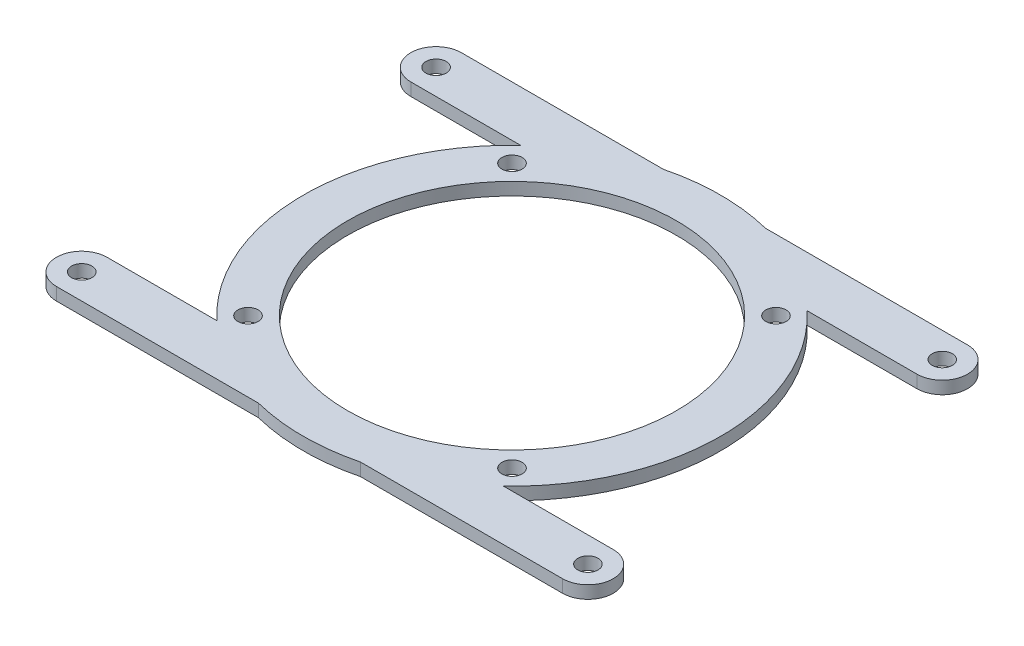
ISO-10303-21;
HEADER;
FILE_DESCRIPTION(('STEP AP214'),'2;1');
FILE_NAME('part.step','',(''),(''),'','','');
FILE_SCHEMA(('AUTOMOTIVE_DESIGN { 1 0 10303 214 1 1 1 1 }'));
ENDSEC;
DATA;
#1=APPLICATION_CONTEXT('core data for automotive mechanical design processes');
#2=APPLICATION_PROTOCOL_DEFINITION('international standard','automotive_design',2000,#1);
#3=PRODUCT_CONTEXT('',#1,'mechanical');
#4=PRODUCT('Part','Part','',(#3));
#5=PRODUCT_RELATED_PRODUCT_CATEGORY('part','',(#4));
#6=PRODUCT_DEFINITION_FORMATION('','',#4);
#7=PRODUCT_DEFINITION_CONTEXT('part definition',#1,'design');
#8=PRODUCT_DEFINITION('design','',#6,#7);
#9=PRODUCT_DEFINITION_SHAPE('','',#8);
#10=(LENGTH_UNIT() NAMED_UNIT(*) SI_UNIT(.MILLI.,.METRE.));
#11=(NAMED_UNIT(*) PLANE_ANGLE_UNIT() SI_UNIT($,.RADIAN.));
#12=(NAMED_UNIT(*) SI_UNIT($,.STERADIAN.) SOLID_ANGLE_UNIT());
#13=UNCERTAINTY_MEASURE_WITH_UNIT(LENGTH_MEASURE(1.E-05),#10,'distance_accuracy_value','');
#14=(GEOMETRIC_REPRESENTATION_CONTEXT(3) GLOBAL_UNCERTAINTY_ASSIGNED_CONTEXT((#13)) GLOBAL_UNIT_ASSIGNED_CONTEXT((#10,
#11,#12)) REPRESENTATION_CONTEXT('',''));
#15=CARTESIAN_POINT('',(0.,0.,0.));
#16=DIRECTION('',(0.,0.,1.));
#17=DIRECTION('',(1.,0.,0.));
#18=AXIS2_PLACEMENT_3D('',#15,#16,#17);
#19=CARTESIAN_POINT('',(0.,-91.9347594764896,-24.));
#20=DIRECTION('',(0.,0.,-1.));
#21=DIRECTION('',(-1.,0.,0.));
#22=AXIS2_PLACEMENT_3D('',#19,#20,#21);
#23=PLANE('',#22);
#24=DIRECTION('',(0.,1.,0.));
#25=VECTOR('',#24,1.);
#26=CARTESIAN_POINT('',(40.,-3.,-24.));
#27=LINE('',#26,#25);
#28=CARTESIAN_POINT('',(40.,0.,-24.));
#29=VERTEX_POINT('',#28);
#30=CARTESIAN_POINT('',(40.,2.,-24.));
#31=VERTEX_POINT('',#30);
#32=EDGE_CURVE('E710',#29,#31,#27,.T.);
#33=ORIENTED_EDGE('',*,*,#32,.T.);
#34=DIRECTION('',(-1.,0.,0.));
#35=VECTOR('',#34,1.);
#36=CARTESIAN_POINT('',(0.,2.,-24.));
#37=LINE('',#36,#35);
#38=CARTESIAN_POINT('',(22.6495033058123,2.,-24.));
#39=VERTEX_POINT('',#38);
#40=EDGE_CURVE('E351',#31,#39,#37,.T.);
#41=ORIENTED_EDGE('',*,*,#40,.T.);
#42=DIRECTION('',(0.,1.,0.));
#43=VECTOR('',#42,1.);
#44=CARTESIAN_POINT('',(22.6495033058123,-91.9347594764896,-24.));
#45=LINE('',#44,#43);
#46=CARTESIAN_POINT('',(22.6495033058123,0.,-24.));
#47=VERTEX_POINT('',#46);
#48=EDGE_CURVE('E353',#47,#39,#45,.T.);
#49=ORIENTED_EDGE('',*,*,#48,.F.);
#50=DIRECTION('',(1.,0.,0.));
#51=VECTOR('',#50,1.);
#52=CARTESIAN_POINT('',(0.,0.,-24.));
#53=LINE('',#52,#51);
#54=EDGE_CURVE('E346',#47,#29,#53,.T.);
#55=ORIENTED_EDGE('',*,*,#54,.T.);
#56=EDGE_LOOP('',(#33,#41,#49,#55));
#57=FACE_BOUND('',#56,.T.);
#58=ADVANCED_FACE('F160',(#57),#23,.F.);
#59=CARTESIAN_POINT('',(0.,2.,0.));
#60=DIRECTION('',(0.,-1.,0.));
#61=DIRECTION('',(0.,0.,-1.));
#62=AXIS2_PLACEMENT_3D('',#59,#60,#61);
#63=CYLINDRICAL_SURFACE('',#62,33.);
#64=DIRECTION('',(0.,1.,0.));
#65=VECTOR('',#64,1.);
#66=CARTESIAN_POINT('',(8.06225774829853,-91.9347594764896,32.));
#67=LINE('',#66,#65);
#68=CARTESIAN_POINT('',(8.06225774829853,0.,32.));
#69=VERTEX_POINT('',#68);
#70=CARTESIAN_POINT('',(8.06225774829853,2.,32.));
#71=VERTEX_POINT('',#70);
#72=EDGE_CURVE('E300',#69,#71,#67,.T.);
#73=ORIENTED_EDGE('',*,*,#72,.T.);
#74=CARTESIAN_POINT('',(0.,2.,0.));
#75=DIRECTION('',(0.,1.,0.));
#76=DIRECTION('',(0.,0.,1.));
#77=AXIS2_PLACEMENT_3D('',#74,#75,#76);
#78=CIRCLE('',#77,33.);
#79=CARTESIAN_POINT('',(-8.06225774829853,2.,32.));
#80=VERTEX_POINT('',#79);
#81=EDGE_CURVE('E299',#80,#71,#78,.T.);
#82=ORIENTED_EDGE('',*,*,#81,.F.);
#83=DIRECTION('',(0.,1.,0.));
#84=VECTOR('',#83,1.);
#85=CARTESIAN_POINT('',(-8.06225774829853,-91.9347594764896,32.));
#86=LINE('',#85,#84);
#87=CARTESIAN_POINT('',(-8.06225774829853,0.,32.));
#88=VERTEX_POINT('',#87);
#89=EDGE_CURVE('E320',#88,#80,#86,.T.);
#90=ORIENTED_EDGE('',*,*,#89,.F.);
#91=CARTESIAN_POINT('',(0.,0.,0.));
#92=DIRECTION('',(0.,1.,0.));
#93=DIRECTION('',(0.,0.,1.));
#94=AXIS2_PLACEMENT_3D('',#91,#92,#93);
#95=CIRCLE('',#94,33.);
#96=EDGE_CURVE('E716',#88,#69,#95,.T.);
#97=ORIENTED_EDGE('',*,*,#96,.T.);
#98=EDGE_LOOP('',(#73,#82,#90,#97));
#99=FACE_BOUND('',#98,.T.);
#100=ADVANCED_FACE('F435',(#99),#63,.T.);
#101=DIRECTION('',(0.,1.,0.));
#102=VECTOR('',#101,1.);
#103=CARTESIAN_POINT('',(-22.6495033058123,-91.9347594764896,24.));
#104=LINE('',#103,#102);
#105=CARTESIAN_POINT('',(-22.6495033058122,0.,24.));
#106=VERTEX_POINT('',#105);
#107=CARTESIAN_POINT('',(-22.6495033058122,2.,24.));
#108=VERTEX_POINT('',#107);
#109=EDGE_CURVE('E323',#106,#108,#104,.T.);
#110=ORIENTED_EDGE('',*,*,#109,.T.);
#111=CARTESIAN_POINT('',(-22.6495033058123,2.,-24.));
#112=VERTEX_POINT('',#111);
#113=EDGE_CURVE('E396',#112,#108,#78,.T.);
#114=ORIENTED_EDGE('',*,*,#113,.F.);
#115=DIRECTION('',(0.,1.,0.));
#116=VECTOR('',#115,1.);
#117=CARTESIAN_POINT('',(-22.6495033058123,-91.9347594764896,-24.));
#118=LINE('',#117,#116);
#119=CARTESIAN_POINT('',(-22.6495033058123,0.,-24.));
#120=VERTEX_POINT('',#119);
#121=EDGE_CURVE('E338',#120,#112,#118,.T.);
#122=ORIENTED_EDGE('',*,*,#121,.F.);
#123=EDGE_CURVE('E401',#120,#106,#95,.T.);
#124=ORIENTED_EDGE('',*,*,#123,.T.);
#125=EDGE_LOOP('',(#110,#114,#122,#124));
#126=FACE_BOUND('',#125,.T.);
#127=ADVANCED_FACE('F162',(#126),#63,.T.);
#128=CARTESIAN_POINT('',(22.6495033058123,2.,24.));
#129=VERTEX_POINT('',#128);
#130=EDGE_CURVE('E397',#129,#39,#78,.T.);
#131=ORIENTED_EDGE('',*,*,#130,.F.);
#132=DIRECTION('',(0.,1.,0.));
#133=VECTOR('',#132,1.);
#134=CARTESIAN_POINT('',(22.6495033058123,-91.9347594764896,24.));
#135=LINE('',#134,#133);
#136=CARTESIAN_POINT('',(22.6495033058123,0.,24.));
#137=VERTEX_POINT('',#136);
#138=EDGE_CURVE('E302',#137,#129,#135,.T.);
#139=ORIENTED_EDGE('',*,*,#138,.F.);
#140=EDGE_CURVE('E390',#137,#47,#95,.T.);
#141=ORIENTED_EDGE('',*,*,#140,.T.);
#142=ORIENTED_EDGE('',*,*,#48,.T.);
#143=EDGE_LOOP('',(#131,#139,#141,#142));
#144=FACE_BOUND('',#143,.T.);
#145=ADVANCED_FACE('F443',(#144),#63,.T.);
#146=CARTESIAN_POINT('',(8.06225774829853,0.,-32.));
#147=VERTEX_POINT('',#146);
#148=CARTESIAN_POINT('',(-8.06225774829853,0.,-32.));
#149=VERTEX_POINT('',#148);
#150=EDGE_CURVE('E398',#147,#149,#95,.T.);
#151=ORIENTED_EDGE('',*,*,#150,.T.);
#152=DIRECTION('',(0.,1.,0.));
#153=VECTOR('',#152,1.);
#154=CARTESIAN_POINT('',(-8.06225774829853,-91.9347594764896,-32.));
#155=LINE('',#154,#153);
#156=CARTESIAN_POINT('',(-8.06225774829853,2.,-32.));
#157=VERTEX_POINT('',#156);
#158=EDGE_CURVE('E319',#149,#157,#155,.T.);
#159=ORIENTED_EDGE('',*,*,#158,.T.);
#160=CARTESIAN_POINT('',(8.06225774829853,2.,-32.));
#161=VERTEX_POINT('',#160);
#162=EDGE_CURVE('E393',#161,#157,#78,.T.);
#163=ORIENTED_EDGE('',*,*,#162,.F.);
#164=DIRECTION('',(0.,1.,0.));
#165=VECTOR('',#164,1.);
#166=CARTESIAN_POINT('',(8.06225774829853,-91.9347594764896,-32.));
#167=LINE('',#166,#165);
#168=EDGE_CURVE('E350',#147,#161,#167,.T.);
#169=ORIENTED_EDGE('',*,*,#168,.F.);
#170=EDGE_LOOP('',(#151,#159,#163,#169));
#171=FACE_BOUND('',#170,.T.);
#172=ADVANCED_FACE('F469',(#171),#63,.T.);
#173=CARTESIAN_POINT('',(0.,2.,0.));
#174=DIRECTION('',(0.,1.,0.));
#175=DIRECTION('',(0.,0.,1.));
#176=AXIS2_PLACEMENT_3D('',#173,#174,#175);
#177=PLANE('',#176);
#178=CARTESIAN_POINT('',(40.,2.,-28.));
#179=DIRECTION('',(0.,-1.,0.));
#180=DIRECTION('',(0.,0.,1.));
#181=AXIS2_PLACEMENT_3D('',#178,#179,#180);
#182=CIRCLE('',#181,4.00000000000001);
#183=CARTESIAN_POINT('',(40.,2.,-32.));
#184=VERTEX_POINT('',#183);
#185=EDGE_CURVE('E746',#184,#31,#182,.T.);
#186=ORIENTED_EDGE('',*,*,#185,.F.);
#187=DIRECTION('',(-1.,0.,0.));
#188=VECTOR('',#187,1.);
#189=CARTESIAN_POINT('',(0.,2.,-32.));
#190=LINE('',#189,#188);
#191=EDGE_CURVE('E347',#184,#161,#190,.T.);
#192=ORIENTED_EDGE('',*,*,#191,.T.);
#193=ORIENTED_EDGE('',*,*,#162,.T.);
#194=DIRECTION('',(-1.,0.,0.));
#195=VECTOR('',#194,1.);
#196=CARTESIAN_POINT('',(0.,2.,-32.));
#197=LINE('',#196,#195);
#198=CARTESIAN_POINT('',(-40.,2.,-32.));
#199=VERTEX_POINT('',#198);
#200=EDGE_CURVE('E332',#157,#199,#197,.T.);
#201=ORIENTED_EDGE('',*,*,#200,.T.);
#202=CARTESIAN_POINT('',(-40.,2.,-28.));
#203=DIRECTION('',(0.,-1.,0.));
#204=DIRECTION('',(0.,0.,-1.));
#205=AXIS2_PLACEMENT_3D('',#202,#203,#204);
#206=CIRCLE('',#205,4.00000000000001);
#207=CARTESIAN_POINT('',(-40.,2.,-24.));
#208=VERTEX_POINT('',#207);
#209=EDGE_CURVE('E705',#208,#199,#206,.T.);
#210=ORIENTED_EDGE('',*,*,#209,.F.);
#211=DIRECTION('',(1.,0.,0.));
#212=VECTOR('',#211,1.);
#213=CARTESIAN_POINT('',(0.,2.,-24.));
#214=LINE('',#213,#212);
#215=EDGE_CURVE('E336',#208,#112,#214,.T.);
#216=ORIENTED_EDGE('',*,*,#215,.T.);
#217=ORIENTED_EDGE('',*,*,#113,.T.);
#218=DIRECTION('',(1.,0.,0.));
#219=VECTOR('',#218,1.);
#220=CARTESIAN_POINT('',(0.,2.,24.));
#221=LINE('',#220,#219);
#222=CARTESIAN_POINT('',(-40.,2.,24.));
#223=VERTEX_POINT('',#222);
#224=EDGE_CURVE('E321',#223,#108,#221,.T.);
#225=ORIENTED_EDGE('',*,*,#224,.F.);
#226=CARTESIAN_POINT('',(-40.,2.,28.));
#227=DIRECTION('',(0.,-1.,0.));
#228=DIRECTION('',(0.,0.,1.));
#229=AXIS2_PLACEMENT_3D('',#226,#227,#228);
#230=CIRCLE('',#229,4.00000000000001);
#231=CARTESIAN_POINT('',(-40.,2.,32.));
#232=VERTEX_POINT('',#231);
#233=EDGE_CURVE('E292',#232,#223,#230,.T.);
#234=ORIENTED_EDGE('',*,*,#233,.F.);
#235=DIRECTION('',(-1.,0.,0.));
#236=VECTOR('',#235,1.);
#237=CARTESIAN_POINT('',(0.,2.,32.));
#238=LINE('',#237,#236);
#239=EDGE_CURVE('E316',#80,#232,#238,.T.);
#240=ORIENTED_EDGE('',*,*,#239,.F.);
#241=ORIENTED_EDGE('',*,*,#81,.T.);
#242=DIRECTION('',(-1.,0.,0.));
#243=VECTOR('',#242,1.);
#244=CARTESIAN_POINT('',(0.,2.,32.));
#245=LINE('',#244,#243);
#246=CARTESIAN_POINT('',(40.,2.,32.));
#247=VERTEX_POINT('',#246);
#248=EDGE_CURVE('E288',#247,#71,#245,.T.);
#249=ORIENTED_EDGE('',*,*,#248,.F.);
#250=CARTESIAN_POINT('',(40.,2.,28.));
#251=DIRECTION('',(0.,-1.,0.));
#252=DIRECTION('',(0.,0.,-1.));
#253=AXIS2_PLACEMENT_3D('',#250,#251,#252);
#254=CIRCLE('',#253,4.00000000000001);
#255=CARTESIAN_POINT('',(40.,2.,24.));
#256=VERTEX_POINT('',#255);
#257=EDGE_CURVE('E273',#256,#247,#254,.T.);
#258=ORIENTED_EDGE('',*,*,#257,.F.);
#259=DIRECTION('',(-1.,0.,0.));
#260=VECTOR('',#259,1.);
#261=CARTESIAN_POINT('',(0.,2.,24.));
#262=LINE('',#261,#260);
#263=EDGE_CURVE('E308',#256,#129,#262,.T.);
#264=ORIENTED_EDGE('',*,*,#263,.T.);
#265=ORIENTED_EDGE('',*,*,#130,.T.);
#266=ORIENTED_EDGE('',*,*,#40,.F.);
#267=EDGE_LOOP('',(#186,#192,#193,#201,#210,#216,#217,#225,#234,#240,#241,#249,#258,#264,#265,#266));
#268=FACE_BOUND('',#267,.T.);
#269=CARTESIAN_POINT('',(40.,2.,-28.));
#270=DIRECTION('',(0.,1.,0.));
#271=DIRECTION('',(0.,0.,1.));
#272=AXIS2_PLACEMENT_3D('',#269,#270,#271);
#273=CIRCLE('',#272,1.6);
#274=CARTESIAN_POINT('',(40.,2.,-26.4));
#275=VERTEX_POINT('',#274);
#276=EDGE_CURVE('E737',#275,#275,#273,.T.);
#277=ORIENTED_EDGE('',*,*,#276,.F.);
#278=EDGE_LOOP('',(#277));
#279=FACE_BOUND('',#278,.T.);
#280=CARTESIAN_POINT('',(-40.,2.,-28.));
#281=DIRECTION('',(0.,1.,0.));
#282=DIRECTION('',(0.,0.,-1.));
#283=AXIS2_PLACEMENT_3D('',#280,#281,#282);
#284=CIRCLE('',#283,1.6);
#285=CARTESIAN_POINT('',(-40.,2.,-29.6));
#286=VERTEX_POINT('',#285);
#287=EDGE_CURVE('E743',#286,#286,#284,.T.);
#288=ORIENTED_EDGE('',*,*,#287,.F.);
#289=EDGE_LOOP('',(#288));
#290=FACE_BOUND('',#289,.T.);
#291=CARTESIAN_POINT('',(-40.,2.,28.));
#292=DIRECTION('',(0.,1.,0.));
#293=DIRECTION('',(0.,0.,1.));
#294=AXIS2_PLACEMENT_3D('',#291,#292,#293);
#295=CIRCLE('',#294,1.6);
#296=CARTESIAN_POINT('',(-40.,2.,29.6));
#297=VERTEX_POINT('',#296);
#298=EDGE_CURVE('E740',#297,#297,#295,.T.);
#299=ORIENTED_EDGE('',*,*,#298,.F.);
#300=EDGE_LOOP('',(#299));
#301=FACE_BOUND('',#300,.T.);
#302=CARTESIAN_POINT('',(40.,2.,28.));
#303=DIRECTION('',(0.,1.,0.));
#304=DIRECTION('',(0.,0.,-1.));
#305=AXIS2_PLACEMENT_3D('',#302,#303,#304);
#306=CIRCLE('',#305,1.6);
#307=CARTESIAN_POINT('',(40.,2.,26.4));
#308=VERTEX_POINT('',#307);
#309=EDGE_CURVE('E744',#308,#308,#306,.T.);
#310=ORIENTED_EDGE('',*,*,#309,.F.);
#311=EDGE_LOOP('',(#310));
#312=FACE_BOUND('',#311,.T.);
#313=CARTESIAN_POINT('',(-20.8596500450031,2.,20.8596500450032));
#314=DIRECTION('',(0.,1.,0.));
#315=DIRECTION('',(0.,0.,1.));
#316=AXIS2_PLACEMENT_3D('',#313,#314,#315);
#317=CIRCLE('',#316,1.6);
#318=CARTESIAN_POINT('',(-20.8596500450031,2.,22.4596500450032));
#319=VERTEX_POINT('',#318);
#320=EDGE_CURVE('E363',#319,#319,#317,.T.);
#321=ORIENTED_EDGE('',*,*,#320,.F.);
#322=EDGE_LOOP('',(#321));
#323=FACE_BOUND('',#322,.T.);
#324=CARTESIAN_POINT('',(-20.8596500450031,2.,-20.8596500450032));
#325=DIRECTION('',(0.,1.,0.));
#326=DIRECTION('',(0.,0.,-1.));
#327=AXIS2_PLACEMENT_3D('',#324,#325,#326);
#328=CIRCLE('',#327,1.6);
#329=CARTESIAN_POINT('',(-20.8596500450031,2.,-22.4596500450032));
#330=VERTEX_POINT('',#329);
#331=EDGE_CURVE('E375',#330,#330,#328,.T.);
#332=ORIENTED_EDGE('',*,*,#331,.F.);
#333=EDGE_LOOP('',(#332));
#334=FACE_BOUND('',#333,.T.);
#335=CARTESIAN_POINT('',(20.8596500450031,2.,-20.8596500450032));
#336=DIRECTION('',(0.,1.,0.));
#337=DIRECTION('',(0.,0.,1.));
#338=AXIS2_PLACEMENT_3D('',#335,#336,#337);
#339=CIRCLE('',#338,1.6);
#340=CARTESIAN_POINT('',(20.8596500450031,2.,-19.2596500450032));
#341=VERTEX_POINT('',#340);
#342=EDGE_CURVE('E381',#341,#341,#339,.T.);
#343=ORIENTED_EDGE('',*,*,#342,.F.);
#344=EDGE_LOOP('',(#343));
#345=FACE_BOUND('',#344,.T.);
#346=CARTESIAN_POINT('',(20.8596500450031,2.,20.8596500450032));
#347=DIRECTION('',(0.,1.,0.));
#348=DIRECTION('',(0.,0.,-1.));
#349=AXIS2_PLACEMENT_3D('',#346,#347,#348);
#350=CIRCLE('',#349,1.6);
#351=CARTESIAN_POINT('',(20.8596500450031,2.,19.2596500450032));
#352=VERTEX_POINT('',#351);
#353=EDGE_CURVE('E369',#352,#352,#350,.T.);
#354=ORIENTED_EDGE('',*,*,#353,.F.);
#355=EDGE_LOOP('',(#354));
#356=FACE_BOUND('',#355,.T.);
#357=CARTESIAN_POINT('',(0.,2.,0.));
#358=DIRECTION('',(0.,1.,0.));
#359=DIRECTION('',(0.,0.,1.));
#360=AXIS2_PLACEMENT_3D('',#357,#358,#359);
#361=CIRCLE('',#360,26.);
#362=CARTESIAN_POINT('',(0.,2.,26.));
#363=VERTEX_POINT('',#362);
#364=EDGE_CURVE('E387',#363,#363,#361,.T.);
#365=ORIENTED_EDGE('',*,*,#364,.F.);
#366=EDGE_LOOP('',(#365));
#367=FACE_BOUND('',#366,.T.);
#368=ADVANCED_FACE('F296',(#268,#279,#290,#301,#312,#323,#334,#345,#356,#367),#177,.T.);
#369=CARTESIAN_POINT('',(0.,0.,0.));
#370=DIRECTION('',(0.,1.,0.));
#371=DIRECTION('',(0.,0.,1.));
#372=AXIS2_PLACEMENT_3D('',#369,#370,#371);
#373=PLANE('',#372);
#374=CARTESIAN_POINT('',(40.,0.,-28.));
#375=DIRECTION('',(0.,1.,0.));
#376=DIRECTION('',(0.,0.,1.));
#377=AXIS2_PLACEMENT_3D('',#374,#375,#376);
#378=CIRCLE('',#377,1.6);
#379=CARTESIAN_POINT('',(40.,0.,-26.4));
#380=VERTEX_POINT('',#379);
#381=EDGE_CURVE('E164',#380,#380,#378,.T.);
#382=ORIENTED_EDGE('',*,*,#381,.T.);
#383=EDGE_LOOP('',(#382));
#384=FACE_BOUND('',#383,.T.);
#385=CARTESIAN_POINT('',(-40.,0.,-28.));
#386=DIRECTION('',(0.,1.,0.));
#387=DIRECTION('',(0.,0.,1.));
#388=AXIS2_PLACEMENT_3D('',#385,#386,#387);
#389=CIRCLE('',#388,1.6);
#390=CARTESIAN_POINT('',(-40.,0.,-26.4));
#391=VERTEX_POINT('',#390);
#392=EDGE_CURVE('E412',#391,#391,#389,.T.);
#393=ORIENTED_EDGE('',*,*,#392,.T.);
#394=EDGE_LOOP('',(#393));
#395=FACE_BOUND('',#394,.T.);
#396=CARTESIAN_POINT('',(-40.,0.,28.));
#397=DIRECTION('',(0.,1.,0.));
#398=DIRECTION('',(0.,0.,1.));
#399=AXIS2_PLACEMENT_3D('',#396,#397,#398);
#400=CIRCLE('',#399,1.6);
#401=CARTESIAN_POINT('',(-40.,0.,29.6));
#402=VERTEX_POINT('',#401);
#403=EDGE_CURVE('E410',#402,#402,#400,.T.);
#404=ORIENTED_EDGE('',*,*,#403,.T.);
#405=EDGE_LOOP('',(#404));
#406=FACE_BOUND('',#405,.T.);
#407=CARTESIAN_POINT('',(40.,0.,28.));
#408=DIRECTION('',(0.,1.,0.));
#409=DIRECTION('',(0.,0.,1.));
#410=AXIS2_PLACEMENT_3D('',#407,#408,#409);
#411=CIRCLE('',#410,1.6);
#412=CARTESIAN_POINT('',(40.,0.,29.6));
#413=VERTEX_POINT('',#412);
#414=EDGE_CURVE('E407',#413,#413,#411,.T.);
#415=ORIENTED_EDGE('',*,*,#414,.T.);
#416=EDGE_LOOP('',(#415));
#417=FACE_BOUND('',#416,.T.);
#418=CARTESIAN_POINT('',(0.,0.,0.));
#419=DIRECTION('',(0.,1.,0.));
#420=DIRECTION('',(0.,0.,1.));
#421=AXIS2_PLACEMENT_3D('',#418,#419,#420);
#422=CIRCLE('',#421,26.);
#423=CARTESIAN_POINT('',(0.,0.,26.));
#424=VERTEX_POINT('',#423);
#425=EDGE_CURVE('E384',#424,#424,#422,.T.);
#426=ORIENTED_EDGE('',*,*,#425,.T.);
#427=EDGE_LOOP('',(#426));
#428=FACE_BOUND('',#427,.T.);
#429=CARTESIAN_POINT('',(20.8596500450031,0.,-20.8596500450032));
#430=DIRECTION('',(0.,1.,0.));
#431=DIRECTION('',(0.,0.,1.));
#432=AXIS2_PLACEMENT_3D('',#429,#430,#431);
#433=CIRCLE('',#432,1.6);
#434=CARTESIAN_POINT('',(20.8596500450031,0.,-19.2596500450032));
#435=VERTEX_POINT('',#434);
#436=EDGE_CURVE('E378',#435,#435,#433,.T.);
#437=ORIENTED_EDGE('',*,*,#436,.T.);
#438=EDGE_LOOP('',(#437));
#439=FACE_BOUND('',#438,.T.);
#440=CARTESIAN_POINT('',(-20.8596500450031,0.,-20.8596500450032));
#441=DIRECTION('',(0.,1.,0.));
#442=DIRECTION('',(0.,0.,-1.));
#443=AXIS2_PLACEMENT_3D('',#440,#441,#442);
#444=CIRCLE('',#443,1.6);
#445=CARTESIAN_POINT('',(-20.8596500450031,0.,-22.4596500450032));
#446=VERTEX_POINT('',#445);
#447=EDGE_CURVE('E372',#446,#446,#444,.T.);
#448=ORIENTED_EDGE('',*,*,#447,.T.);
#449=EDGE_LOOP('',(#448));
#450=FACE_BOUND('',#449,.T.);
#451=CARTESIAN_POINT('',(20.8596500450031,0.,20.8596500450032));
#452=DIRECTION('',(0.,1.,0.));
#453=DIRECTION('',(0.,0.,-1.));
#454=AXIS2_PLACEMENT_3D('',#451,#452,#453);
#455=CIRCLE('',#454,1.6);
#456=CARTESIAN_POINT('',(20.8596500450031,0.,19.2596500450032));
#457=VERTEX_POINT('',#456);
#458=EDGE_CURVE('E366',#457,#457,#455,.T.);
#459=ORIENTED_EDGE('',*,*,#458,.T.);
#460=EDGE_LOOP('',(#459));
#461=FACE_BOUND('',#460,.T.);
#462=CARTESIAN_POINT('',(-20.8596500450031,0.,20.8596500450032));
#463=DIRECTION('',(0.,1.,0.));
#464=DIRECTION('',(0.,0.,1.));
#465=AXIS2_PLACEMENT_3D('',#462,#463,#464);
#466=CIRCLE('',#465,1.6);
#467=CARTESIAN_POINT('',(-20.8596500450031,0.,22.4596500450032));
#468=VERTEX_POINT('',#467);
#469=EDGE_CURVE('E362',#468,#468,#466,.T.);
#470=ORIENTED_EDGE('',*,*,#469,.T.);
#471=EDGE_LOOP('',(#470));
#472=FACE_BOUND('',#471,.T.);
#473=DIRECTION('',(1.,0.,0.));
#474=VECTOR('',#473,1.);
#475=CARTESIAN_POINT('',(0.,0.,-32.));
#476=LINE('',#475,#474);
#477=CARTESIAN_POINT('',(40.,0.,-32.));
#478=VERTEX_POINT('',#477);
#479=EDGE_CURVE('E349',#147,#478,#476,.T.);
#480=ORIENTED_EDGE('',*,*,#479,.T.);
#481=CARTESIAN_POINT('',(40.,0.,-28.));
#482=DIRECTION('',(0.,1.,0.));
#483=DIRECTION('',(0.,0.,1.));
#484=AXIS2_PLACEMENT_3D('',#481,#482,#483);
#485=CIRCLE('',#484,4.00000000000001);
#486=EDGE_CURVE('E176',#478,#29,#485,.F.);
#487=ORIENTED_EDGE('',*,*,#486,.T.);
#488=ORIENTED_EDGE('',*,*,#54,.F.);
#489=ORIENTED_EDGE('',*,*,#140,.F.);
#490=DIRECTION('',(1.,0.,0.));
#491=VECTOR('',#490,1.);
#492=CARTESIAN_POINT('',(0.,0.,24.));
#493=LINE('',#492,#491);
#494=CARTESIAN_POINT('',(40.,0.,24.));
#495=VERTEX_POINT('',#494);
#496=EDGE_CURVE('E309',#137,#495,#493,.T.);
#497=ORIENTED_EDGE('',*,*,#496,.T.);
#498=CARTESIAN_POINT('',(40.,0.,28.));
#499=DIRECTION('',(0.,1.,0.));
#500=DIRECTION('',(0.,0.,1.));
#501=AXIS2_PLACEMENT_3D('',#498,#499,#500);
#502=CIRCLE('',#501,4.00000000000001);
#503=CARTESIAN_POINT('',(40.,0.,32.));
#504=VERTEX_POINT('',#503);
#505=EDGE_CURVE('E732',#495,#504,#502,.F.);
#506=ORIENTED_EDGE('',*,*,#505,.T.);
#507=DIRECTION('',(1.,0.,0.));
#508=VECTOR('',#507,1.);
#509=CARTESIAN_POINT('',(0.,0.,32.));
#510=LINE('',#509,#508);
#511=EDGE_CURVE('E291',#69,#504,#510,.T.);
#512=ORIENTED_EDGE('',*,*,#511,.F.);
#513=ORIENTED_EDGE('',*,*,#96,.F.);
#514=DIRECTION('',(1.,0.,0.));
#515=VECTOR('',#514,1.);
#516=CARTESIAN_POINT('',(0.,0.,32.));
#517=LINE('',#516,#515);
#518=CARTESIAN_POINT('',(-40.,0.,32.));
#519=VERTEX_POINT('',#518);
#520=EDGE_CURVE('E326',#519,#88,#517,.T.);
#521=ORIENTED_EDGE('',*,*,#520,.F.);
#522=CARTESIAN_POINT('',(-40.,0.,28.));
#523=DIRECTION('',(0.,1.,0.));
#524=DIRECTION('',(0.,0.,1.));
#525=AXIS2_PLACEMENT_3D('',#522,#523,#524);
#526=CIRCLE('',#525,4.00000000000001);
#527=CARTESIAN_POINT('',(-40.,0.,24.));
#528=VERTEX_POINT('',#527);
#529=EDGE_CURVE('E727',#519,#528,#526,.F.);
#530=ORIENTED_EDGE('',*,*,#529,.T.);
#531=DIRECTION('',(-1.,0.,0.));
#532=VECTOR('',#531,1.);
#533=CARTESIAN_POINT('',(0.,0.,24.));
#534=LINE('',#533,#532);
#535=EDGE_CURVE('E315',#106,#528,#534,.T.);
#536=ORIENTED_EDGE('',*,*,#535,.F.);
#537=ORIENTED_EDGE('',*,*,#123,.F.);
#538=DIRECTION('',(-1.,0.,0.));
#539=VECTOR('',#538,1.);
#540=CARTESIAN_POINT('',(0.,0.,-24.));
#541=LINE('',#540,#539);
#542=CARTESIAN_POINT('',(-40.,0.,-24.));
#543=VERTEX_POINT('',#542);
#544=EDGE_CURVE('E343',#120,#543,#541,.T.);
#545=ORIENTED_EDGE('',*,*,#544,.T.);
#546=CARTESIAN_POINT('',(-40.,0.,-28.));
#547=DIRECTION('',(0.,1.,0.));
#548=DIRECTION('',(0.,0.,1.));
#549=AXIS2_PLACEMENT_3D('',#546,#547,#548);
#550=CIRCLE('',#549,4.00000000000001);
#551=CARTESIAN_POINT('',(-40.,0.,-32.));
#552=VERTEX_POINT('',#551);
#553=EDGE_CURVE('E184',#543,#552,#550,.F.);
#554=ORIENTED_EDGE('',*,*,#553,.T.);
#555=DIRECTION('',(1.,0.,0.));
#556=VECTOR('',#555,1.);
#557=CARTESIAN_POINT('',(0.,0.,-32.));
#558=LINE('',#557,#556);
#559=EDGE_CURVE('E335',#552,#149,#558,.T.);
#560=ORIENTED_EDGE('',*,*,#559,.T.);
#561=ORIENTED_EDGE('',*,*,#150,.F.);
#562=EDGE_LOOP('',(#480,#487,#488,#489,#497,#506,#512,#513,#521,#530,#536,#537,#545,#554,#560,#561));
#563=FACE_BOUND('',#562,.T.);
#564=ADVANCED_FACE('F419',(#384,#395,#406,#417,#428,#439,#450,#461,#472,#563),#373,.F.);
#565=CARTESIAN_POINT('',(0.,2.,0.));
#566=DIRECTION('',(0.,-1.,0.));
#567=DIRECTION('',(0.,0.,-1.));
#568=AXIS2_PLACEMENT_3D('',#565,#566,#567);
#569=CYLINDRICAL_SURFACE('',#568,26.);
#570=ORIENTED_EDGE('',*,*,#425,.F.);
#571=EDGE_LOOP('',(#570));
#572=FACE_BOUND('',#571,.T.);
#573=ORIENTED_EDGE('',*,*,#364,.T.);
#574=EDGE_LOOP('',(#573));
#575=FACE_BOUND('',#574,.T.);
#576=ADVANCED_FACE('F463',(#572,#575),#569,.F.);
#577=CARTESIAN_POINT('',(20.8596500450031,2.,-20.8596500450032));
#578=DIRECTION('',(0.,-1.,0.));
#579=DIRECTION('',(0.,0.,-1.));
#580=AXIS2_PLACEMENT_3D('',#577,#578,#579);
#581=CYLINDRICAL_SURFACE('',#580,1.6);
#582=ORIENTED_EDGE('',*,*,#342,.T.);
#583=EDGE_LOOP('',(#582));
#584=FACE_BOUND('',#583,.T.);
#585=ORIENTED_EDGE('',*,*,#436,.F.);
#586=EDGE_LOOP('',(#585));
#587=FACE_BOUND('',#586,.T.);
#588=ADVANCED_FACE('F459',(#584,#587),#581,.F.);
#589=CARTESIAN_POINT('',(-20.8596500450031,2.,-20.8596500450032));
#590=DIRECTION('',(0.,-1.,0.));
#591=DIRECTION('',(0.,0.,-1.));
#592=AXIS2_PLACEMENT_3D('',#589,#590,#591);
#593=CYLINDRICAL_SURFACE('',#592,1.6);
#594=ORIENTED_EDGE('',*,*,#331,.T.);
#595=EDGE_LOOP('',(#594));
#596=FACE_BOUND('',#595,.T.);
#597=ORIENTED_EDGE('',*,*,#447,.F.);
#598=EDGE_LOOP('',(#597));
#599=FACE_BOUND('',#598,.T.);
#600=ADVANCED_FACE('F455',(#596,#599),#593,.F.);
#601=CARTESIAN_POINT('',(20.8596500450031,2.,20.8596500450032));
#602=DIRECTION('',(0.,-1.,0.));
#603=DIRECTION('',(0.,0.,-1.));
#604=AXIS2_PLACEMENT_3D('',#601,#602,#603);
#605=CYLINDRICAL_SURFACE('',#604,1.6);
#606=ORIENTED_EDGE('',*,*,#353,.T.);
#607=EDGE_LOOP('',(#606));
#608=FACE_BOUND('',#607,.T.);
#609=ORIENTED_EDGE('',*,*,#458,.F.);
#610=EDGE_LOOP('',(#609));
#611=FACE_BOUND('',#610,.T.);
#612=ADVANCED_FACE('F451',(#608,#611),#605,.F.);
#613=CARTESIAN_POINT('',(-20.8596500450031,2.,20.8596500450032));
#614=DIRECTION('',(0.,-1.,0.));
#615=DIRECTION('',(0.,0.,-1.));
#616=AXIS2_PLACEMENT_3D('',#613,#614,#615);
#617=CYLINDRICAL_SURFACE('',#616,1.6);
#618=ORIENTED_EDGE('',*,*,#320,.T.);
#619=EDGE_LOOP('',(#618));
#620=FACE_BOUND('',#619,.T.);
#621=ORIENTED_EDGE('',*,*,#469,.F.);
#622=EDGE_LOOP('',(#621));
#623=FACE_BOUND('',#622,.T.);
#624=ADVANCED_FACE('F449',(#620,#623),#617,.F.);
#625=CARTESIAN_POINT('',(0.,-91.9347594764896,-32.));
#626=DIRECTION('',(0.,0.,-1.));
#627=DIRECTION('',(-1.,0.,0.));
#628=AXIS2_PLACEMENT_3D('',#625,#626,#627);
#629=PLANE('',#628);
#630=DIRECTION('',(0.,1.,0.));
#631=VECTOR('',#630,1.);
#632=CARTESIAN_POINT('',(40.,-91.9347594764896,-32.));
#633=LINE('',#632,#631);
#634=EDGE_CURVE('E12',#478,#184,#633,.T.);
#635=ORIENTED_EDGE('',*,*,#634,.F.);
#636=ORIENTED_EDGE('',*,*,#479,.F.);
#637=ORIENTED_EDGE('',*,*,#168,.T.);
#638=ORIENTED_EDGE('',*,*,#191,.F.);
#639=EDGE_LOOP('',(#635,#636,#637,#638));
#640=FACE_BOUND('',#639,.T.);
#641=ADVANCED_FACE('F447',(#640),#629,.T.);
#642=CARTESIAN_POINT('',(0.,-91.9347594764896,-32.));
#643=DIRECTION('',(0.,0.,-1.));
#644=DIRECTION('',(-1.,0.,0.));
#645=AXIS2_PLACEMENT_3D('',#642,#643,#644);
#646=PLANE('',#645);
#647=DIRECTION('',(0.,1.,0.));
#648=VECTOR('',#647,1.);
#649=CARTESIAN_POINT('',(-40.,-3.,-32.));
#650=LINE('',#649,#648);
#651=EDGE_CURVE('E703',#552,#199,#650,.T.);
#652=ORIENTED_EDGE('',*,*,#651,.T.);
#653=ORIENTED_EDGE('',*,*,#200,.F.);
#654=ORIENTED_EDGE('',*,*,#158,.F.);
#655=ORIENTED_EDGE('',*,*,#559,.F.);
#656=EDGE_LOOP('',(#652,#653,#654,#655));
#657=FACE_BOUND('',#656,.T.);
#658=ADVANCED_FACE('F482',(#657),#646,.T.);
#659=CARTESIAN_POINT('',(0.,-91.9347594764896,-24.));
#660=DIRECTION('',(0.,0.,1.));
#661=DIRECTION('',(1.,0.,0.));
#662=AXIS2_PLACEMENT_3D('',#659,#660,#661);
#663=PLANE('',#662);
#664=DIRECTION('',(0.,1.,0.));
#665=VECTOR('',#664,1.);
#666=CARTESIAN_POINT('',(-40.,-91.9347594764896,-24.));
#667=LINE('',#666,#665);
#668=EDGE_CURVE('E169',#543,#208,#667,.T.);
#669=ORIENTED_EDGE('',*,*,#668,.F.);
#670=ORIENTED_EDGE('',*,*,#544,.F.);
#671=ORIENTED_EDGE('',*,*,#121,.T.);
#672=ORIENTED_EDGE('',*,*,#215,.F.);
#673=EDGE_LOOP('',(#669,#670,#671,#672));
#674=FACE_BOUND('',#673,.T.);
#675=ADVANCED_FACE('F489',(#674),#663,.T.);
#676=CARTESIAN_POINT('',(0.,-91.9347594764896,24.));
#677=DIRECTION('',(0.,0.,1.));
#678=DIRECTION('',(1.,0.,0.));
#679=AXIS2_PLACEMENT_3D('',#676,#677,#678);
#680=PLANE('',#679);
#681=ORIENTED_EDGE('',*,*,#535,.T.);
#682=DIRECTION('',(0.,1.,0.));
#683=VECTOR('',#682,1.);
#684=CARTESIAN_POINT('',(-40.,-3.,24.));
#685=LINE('',#684,#683);
#686=EDGE_CURVE('E730',#528,#223,#685,.T.);
#687=ORIENTED_EDGE('',*,*,#686,.T.);
#688=ORIENTED_EDGE('',*,*,#224,.T.);
#689=ORIENTED_EDGE('',*,*,#109,.F.);
#690=EDGE_LOOP('',(#681,#687,#688,#689));
#691=FACE_BOUND('',#690,.T.);
#692=ADVANCED_FACE('F496',(#691),#680,.F.);
#693=CARTESIAN_POINT('',(0.,-91.9347594764896,32.));
#694=DIRECTION('',(0.,0.,-1.));
#695=DIRECTION('',(-1.,0.,0.));
#696=AXIS2_PLACEMENT_3D('',#693,#694,#695);
#697=PLANE('',#696);
#698=ORIENTED_EDGE('',*,*,#239,.T.);
#699=DIRECTION('',(0.,-1.,0.));
#700=VECTOR('',#699,1.);
#701=CARTESIAN_POINT('',(-40.,-91.9347594764896,32.));
#702=LINE('',#701,#700);
#703=EDGE_CURVE('E403',#232,#519,#702,.T.);
#704=ORIENTED_EDGE('',*,*,#703,.T.);
#705=ORIENTED_EDGE('',*,*,#520,.T.);
#706=ORIENTED_EDGE('',*,*,#89,.T.);
#707=EDGE_LOOP('',(#698,#704,#705,#706));
#708=FACE_BOUND('',#707,.T.);
#709=ADVANCED_FACE('F504',(#708),#697,.F.);
#710=CARTESIAN_POINT('',(0.,-91.9347594764896,32.));
#711=DIRECTION('',(0.,0.,-1.));
#712=DIRECTION('',(-1.,0.,0.));
#713=AXIS2_PLACEMENT_3D('',#710,#711,#712);
#714=PLANE('',#713);
#715=ORIENTED_EDGE('',*,*,#511,.T.);
#716=DIRECTION('',(0.,1.,0.));
#717=VECTOR('',#716,1.);
#718=CARTESIAN_POINT('',(40.,-3.,32.));
#719=LINE('',#718,#717);
#720=EDGE_CURVE('E276',#504,#247,#719,.T.);
#721=ORIENTED_EDGE('',*,*,#720,.T.);
#722=ORIENTED_EDGE('',*,*,#248,.T.);
#723=ORIENTED_EDGE('',*,*,#72,.F.);
#724=EDGE_LOOP('',(#715,#721,#722,#723));
#725=FACE_BOUND('',#724,.T.);
#726=ADVANCED_FACE('F286',(#725),#714,.F.);
#727=CARTESIAN_POINT('',(0.,-91.9347594764896,24.));
#728=DIRECTION('',(0.,0.,-1.));
#729=DIRECTION('',(-1.,0.,0.));
#730=AXIS2_PLACEMENT_3D('',#727,#728,#729);
#731=PLANE('',#730);
#732=DIRECTION('',(0.,1.,0.));
#733=VECTOR('',#732,1.);
#734=CARTESIAN_POINT('',(40.,-91.9347594764896,24.));
#735=LINE('',#734,#733);
#736=EDGE_CURVE('E279',#495,#256,#735,.T.);
#737=ORIENTED_EDGE('',*,*,#736,.F.);
#738=ORIENTED_EDGE('',*,*,#496,.F.);
#739=ORIENTED_EDGE('',*,*,#138,.T.);
#740=ORIENTED_EDGE('',*,*,#263,.F.);
#741=EDGE_LOOP('',(#737,#738,#739,#740));
#742=FACE_BOUND('',#741,.T.);
#743=ADVANCED_FACE('F519',(#742),#731,.T.);
#744=CARTESIAN_POINT('',(40.,-3.,28.));
#745=DIRECTION('',(0.,1.,0.));
#746=DIRECTION('',(0.,0.,1.));
#747=AXIS2_PLACEMENT_3D('',#744,#745,#746);
#748=CYLINDRICAL_SURFACE('',#747,4.00000000000001);
#749=ORIENTED_EDGE('',*,*,#736,.T.);
#750=ORIENTED_EDGE('',*,*,#257,.T.);
#751=ORIENTED_EDGE('',*,*,#720,.F.);
#752=ORIENTED_EDGE('',*,*,#505,.F.);
#753=EDGE_LOOP('',(#749,#750,#751,#752));
#754=FACE_BOUND('',#753,.T.);
#755=ADVANCED_FACE('F275',(#754),#748,.T.);
#756=CARTESIAN_POINT('',(-40.,-3.,28.));
#757=DIRECTION('',(0.,1.,0.));
#758=DIRECTION('',(0.,0.,1.));
#759=AXIS2_PLACEMENT_3D('',#756,#757,#758);
#760=CYLINDRICAL_SURFACE('',#759,4.00000000000001);
#761=ORIENTED_EDGE('',*,*,#703,.F.);
#762=ORIENTED_EDGE('',*,*,#233,.T.);
#763=ORIENTED_EDGE('',*,*,#686,.F.);
#764=ORIENTED_EDGE('',*,*,#529,.F.);
#765=EDGE_LOOP('',(#761,#762,#763,#764));
#766=FACE_BOUND('',#765,.T.);
#767=ADVANCED_FACE('F533',(#766),#760,.T.);
#768=CARTESIAN_POINT('',(-40.,-3.,-28.));
#769=DIRECTION('',(0.,1.,0.));
#770=DIRECTION('',(0.,0.,1.));
#771=AXIS2_PLACEMENT_3D('',#768,#769,#770);
#772=CYLINDRICAL_SURFACE('',#771,4.00000000000001);
#773=ORIENTED_EDGE('',*,*,#668,.T.);
#774=ORIENTED_EDGE('',*,*,#209,.T.);
#775=ORIENTED_EDGE('',*,*,#651,.F.);
#776=ORIENTED_EDGE('',*,*,#553,.F.);
#777=EDGE_LOOP('',(#773,#774,#775,#776));
#778=FACE_BOUND('',#777,.T.);
#779=ADVANCED_FACE('F540',(#778),#772,.T.);
#780=CARTESIAN_POINT('',(40.,-3.,-28.));
#781=DIRECTION('',(0.,1.,0.));
#782=DIRECTION('',(0.,0.,1.));
#783=AXIS2_PLACEMENT_3D('',#780,#781,#782);
#784=CYLINDRICAL_SURFACE('',#783,4.00000000000001);
#785=ORIENTED_EDGE('',*,*,#634,.T.);
#786=ORIENTED_EDGE('',*,*,#185,.T.);
#787=ORIENTED_EDGE('',*,*,#32,.F.);
#788=ORIENTED_EDGE('',*,*,#486,.F.);
#789=EDGE_LOOP('',(#785,#786,#787,#788));
#790=FACE_BOUND('',#789,.T.);
#791=ADVANCED_FACE('F548',(#790),#784,.T.);
#792=CARTESIAN_POINT('',(40.,-3.,28.));
#793=DIRECTION('',(0.,1.,0.));
#794=DIRECTION('',(0.,0.,1.));
#795=AXIS2_PLACEMENT_3D('',#792,#793,#794);
#796=CYLINDRICAL_SURFACE('',#795,1.6);
#797=ORIENTED_EDGE('',*,*,#309,.T.);
#798=EDGE_LOOP('',(#797));
#799=FACE_BOUND('',#798,.T.);
#800=ORIENTED_EDGE('',*,*,#414,.F.);
#801=EDGE_LOOP('',(#800));
#802=FACE_BOUND('',#801,.T.);
#803=ADVANCED_FACE('F555',(#799,#802),#796,.F.);
#804=CARTESIAN_POINT('',(-40.,-3.,28.));
#805=DIRECTION('',(0.,1.,0.));
#806=DIRECTION('',(0.,0.,1.));
#807=AXIS2_PLACEMENT_3D('',#804,#805,#806);
#808=CYLINDRICAL_SURFACE('',#807,1.6);
#809=ORIENTED_EDGE('',*,*,#298,.T.);
#810=EDGE_LOOP('',(#809));
#811=FACE_BOUND('',#810,.T.);
#812=ORIENTED_EDGE('',*,*,#403,.F.);
#813=EDGE_LOOP('',(#812));
#814=FACE_BOUND('',#813,.T.);
#815=ADVANCED_FACE('F429',(#811,#814),#808,.F.);
#816=CARTESIAN_POINT('',(-40.,-3.,-28.));
#817=DIRECTION('',(0.,1.,0.));
#818=DIRECTION('',(0.,0.,1.));
#819=AXIS2_PLACEMENT_3D('',#816,#817,#818);
#820=CYLINDRICAL_SURFACE('',#819,1.6);
#821=ORIENTED_EDGE('',*,*,#287,.T.);
#822=EDGE_LOOP('',(#821));
#823=FACE_BOUND('',#822,.T.);
#824=ORIENTED_EDGE('',*,*,#392,.F.);
#825=EDGE_LOOP('',(#824));
#826=FACE_BOUND('',#825,.T.);
#827=ADVANCED_FACE('F423',(#823,#826),#820,.F.);
#828=CARTESIAN_POINT('',(40.,-3.,-28.));
#829=DIRECTION('',(0.,1.,0.));
#830=DIRECTION('',(0.,0.,1.));
#831=AXIS2_PLACEMENT_3D('',#828,#829,#830);
#832=CYLINDRICAL_SURFACE('',#831,1.6);
#833=ORIENTED_EDGE('',*,*,#276,.T.);
#834=EDGE_LOOP('',(#833));
#835=FACE_BOUND('',#834,.T.);
#836=ORIENTED_EDGE('',*,*,#381,.F.);
#837=EDGE_LOOP('',(#836));
#838=FACE_BOUND('',#837,.T.);
#839=ADVANCED_FACE('F421',(#835,#838),#832,.F.);
#840=CLOSED_SHELL('',(#58,#100,#127,#145,#172,#368,#564,#576,#588,#600,#612,#624,#641,#658,#675,
#692,#709,#726,#743,#755,#767,#779,#791,#803,#815,#827,#839));
#841=MANIFOLD_SOLID_BREP('B2',#840);
#842=ADVANCED_BREP_SHAPE_REPRESENTATION('',(#18,#841),#14);
#843=SHAPE_DEFINITION_REPRESENTATION(#9,#842);
ENDSEC;
END-ISO-10303-21;
